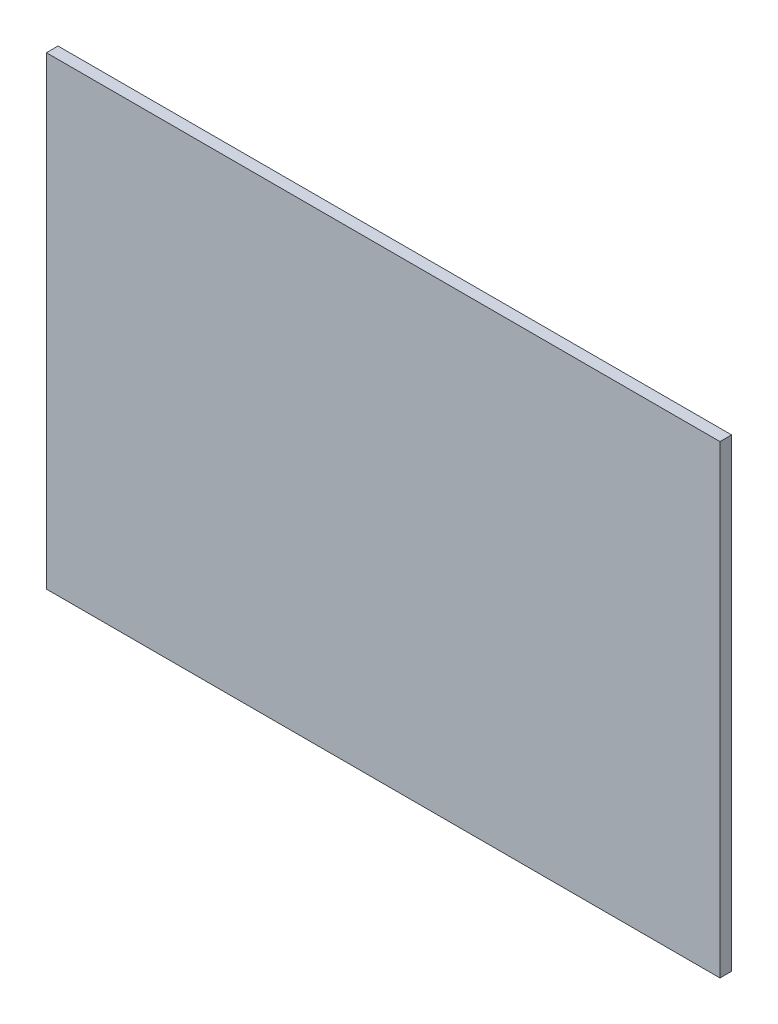
ISO-10303-21;
HEADER;
FILE_DESCRIPTION(('STEP AP214'),'2;1');
FILE_NAME('part.step','',(''),(''),'','','');
FILE_SCHEMA(('AUTOMOTIVE_DESIGN { 1 0 10303 214 1 1 1 1 }'));
ENDSEC;
DATA;
#1=APPLICATION_CONTEXT('core data for automotive mechanical design processes');
#2=APPLICATION_PROTOCOL_DEFINITION('international standard','automotive_design',2000,#1);
#3=PRODUCT_CONTEXT('',#1,'mechanical');
#4=PRODUCT('Part','Part','',(#3));
#5=PRODUCT_RELATED_PRODUCT_CATEGORY('part','',(#4));
#6=PRODUCT_DEFINITION_FORMATION('','',#4);
#7=PRODUCT_DEFINITION_CONTEXT('part definition',#1,'design');
#8=PRODUCT_DEFINITION('design','',#6,#7);
#9=PRODUCT_DEFINITION_SHAPE('','',#8);
#10=(LENGTH_UNIT() NAMED_UNIT(*) SI_UNIT(.MILLI.,.METRE.));
#11=(NAMED_UNIT(*) PLANE_ANGLE_UNIT() SI_UNIT($,.RADIAN.));
#12=(NAMED_UNIT(*) SI_UNIT($,.STERADIAN.) SOLID_ANGLE_UNIT());
#13=UNCERTAINTY_MEASURE_WITH_UNIT(LENGTH_MEASURE(1.E-05),#10,'distance_accuracy_value','');
#14=(GEOMETRIC_REPRESENTATION_CONTEXT(3) GLOBAL_UNCERTAINTY_ASSIGNED_CONTEXT((#13)) GLOBAL_UNIT_ASSIGNED_CONTEXT((#10,
#11,#12)) REPRESENTATION_CONTEXT('',''));
#15=CARTESIAN_POINT('',(0.,0.,0.));
#16=DIRECTION('',(0.,0.,1.));
#17=DIRECTION('',(1.,0.,0.));
#18=AXIS2_PLACEMENT_3D('',#15,#16,#17);
#19=CARTESIAN_POINT('',(-59.8125438596491,34.9027192982456,2.54));
#20=DIRECTION('',(1.,0.,0.));
#21=DIRECTION('',(0.,1.,0.));
#22=AXIS2_PLACEMENT_3D('',#19,#20,#21);
#23=PLANE('',#22);
#24=DIRECTION('',(0.,-1.,0.));
#25=VECTOR('',#24,1.);
#26=CARTESIAN_POINT('',(-59.8125438596491,34.9027192982456,0.));
#27=LINE('',#26,#25);
#28=CARTESIAN_POINT('',(-59.8125438596491,34.9027192982456,0.));
#29=VERTEX_POINT('',#28);
#30=CARTESIAN_POINT('',(-59.8125438596491,-66.6972781617544,0.));
#31=VERTEX_POINT('',#30);
#32=EDGE_CURVE('E109',#29,#31,#27,.T.);
#33=ORIENTED_EDGE('',*,*,#32,.T.);
#34=DIRECTION('',(0.,0.,-1.));
#35=VECTOR('',#34,1.);
#36=CARTESIAN_POINT('',(-59.8125438596491,-66.6972781617544,2.54));
#37=LINE('',#36,#35);
#38=CARTESIAN_POINT('',(-59.8125438596491,-66.6972781617544,2.54));
#39=VERTEX_POINT('',#38);
#40=EDGE_CURVE('E11',#39,#31,#37,.T.);
#41=ORIENTED_EDGE('',*,*,#40,.F.);
#42=DIRECTION('',(0.,-1.,0.));
#43=VECTOR('',#42,1.);
#44=CARTESIAN_POINT('',(-59.8125438596491,34.9027192982456,2.54));
#45=LINE('',#44,#43);
#46=CARTESIAN_POINT('',(-59.8125438596491,34.9027192982456,2.54));
#47=VERTEX_POINT('',#46);
#48=EDGE_CURVE('E93',#47,#39,#45,.T.);
#49=ORIENTED_EDGE('',*,*,#48,.F.);
#50=DIRECTION('',(0.,0.,-1.));
#51=VECTOR('',#50,1.);
#52=CARTESIAN_POINT('',(-59.8125438596491,34.9027192982456,2.54));
#53=LINE('',#52,#51);
#54=EDGE_CURVE('E105',#47,#29,#53,.T.);
#55=ORIENTED_EDGE('',*,*,#54,.T.);
#56=EDGE_LOOP('',(#33,#41,#49,#55));
#57=FACE_BOUND('',#56,.T.);
#58=ADVANCED_FACE('F41',(#57),#23,.F.);
#59=CARTESIAN_POINT('',(-59.8125438596491,-66.6972781617544,2.54));
#60=DIRECTION('',(0.,1.,0.));
#61=DIRECTION('',(0.,0.,1.));
#62=AXIS2_PLACEMENT_3D('',#59,#60,#61);
#63=PLANE('',#62);
#64=DIRECTION('',(1.,0.,0.));
#65=VECTOR('',#64,1.);
#66=CARTESIAN_POINT('',(-59.8125438596491,-66.6972781617544,0.));
#67=LINE('',#66,#65);
#68=CARTESIAN_POINT('',(87.5074561403509,-66.6972781617544,0.));
#69=VERTEX_POINT('',#68);
#70=EDGE_CURVE('E98',#31,#69,#67,.T.);
#71=ORIENTED_EDGE('',*,*,#70,.T.);
#72=DIRECTION('',(0.,0.,-1.));
#73=VECTOR('',#72,1.);
#74=CARTESIAN_POINT('',(87.5074561403509,-66.6972781617544,2.54));
#75=LINE('',#74,#73);
#76=CARTESIAN_POINT('',(87.5074561403509,-66.6972781617544,2.54));
#77=VERTEX_POINT('',#76);
#78=EDGE_CURVE('E50',#77,#69,#75,.T.);
#79=ORIENTED_EDGE('',*,*,#78,.F.);
#80=DIRECTION('',(1.,0.,0.));
#81=VECTOR('',#80,1.);
#82=CARTESIAN_POINT('',(-59.8125438596491,-66.6972781617544,2.54));
#83=LINE('',#82,#81);
#84=EDGE_CURVE('E88',#39,#77,#83,.T.);
#85=ORIENTED_EDGE('',*,*,#84,.F.);
#86=ORIENTED_EDGE('',*,*,#40,.T.);
#87=EDGE_LOOP('',(#71,#79,#85,#86));
#88=FACE_BOUND('',#87,.T.);
#89=ADVANCED_FACE('F97',(#88),#63,.F.);
#90=CARTESIAN_POINT('',(87.5074561403509,34.9027192982456,2.54));
#91=DIRECTION('',(-1.,0.,0.));
#92=DIRECTION('',(0.,0.,1.));
#93=AXIS2_PLACEMENT_3D('',#90,#91,#92);
#94=PLANE('',#93);
#95=DIRECTION('',(0.,1.,0.));
#96=VECTOR('',#95,1.);
#97=CARTESIAN_POINT('',(87.5074561403509,34.9027192982456,0.));
#98=LINE('',#97,#96);
#99=CARTESIAN_POINT('',(87.5074561403509,34.9027192982456,0.));
#100=VERTEX_POINT('',#99);
#101=EDGE_CURVE('E75',#69,#100,#98,.T.);
#102=ORIENTED_EDGE('',*,*,#101,.T.);
#103=DIRECTION('',(0.,0.,-1.));
#104=VECTOR('',#103,1.);
#105=CARTESIAN_POINT('',(87.5074561403509,34.9027192982456,2.54));
#106=LINE('',#105,#104);
#107=CARTESIAN_POINT('',(87.5074561403509,34.9027192982456,2.54));
#108=VERTEX_POINT('',#107);
#109=EDGE_CURVE('E100',#108,#100,#106,.T.);
#110=ORIENTED_EDGE('',*,*,#109,.F.);
#111=DIRECTION('',(0.,1.,0.));
#112=VECTOR('',#111,1.);
#113=CARTESIAN_POINT('',(87.5074561403509,34.9027192982456,2.54));
#114=LINE('',#113,#112);
#115=EDGE_CURVE('E91',#77,#108,#114,.T.);
#116=ORIENTED_EDGE('',*,*,#115,.F.);
#117=ORIENTED_EDGE('',*,*,#78,.T.);
#118=EDGE_LOOP('',(#102,#110,#116,#117));
#119=FACE_BOUND('',#118,.T.);
#120=ADVANCED_FACE('F101',(#119),#94,.F.);
#121=CARTESIAN_POINT('',(-59.8125438596491,34.9027192982456,2.54));
#122=DIRECTION('',(0.,-1.,0.));
#123=DIRECTION('',(0.,0.,-1.));
#124=AXIS2_PLACEMENT_3D('',#121,#122,#123);
#125=PLANE('',#124);
#126=DIRECTION('',(-1.,0.,0.));
#127=VECTOR('',#126,1.);
#128=CARTESIAN_POINT('',(-59.8125438596491,34.9027192982456,0.));
#129=LINE('',#128,#127);
#130=EDGE_CURVE('E81',#100,#29,#129,.T.);
#131=ORIENTED_EDGE('',*,*,#130,.T.);
#132=ORIENTED_EDGE('',*,*,#54,.F.);
#133=DIRECTION('',(-1.,0.,0.));
#134=VECTOR('',#133,1.);
#135=CARTESIAN_POINT('',(-59.8125438596491,34.9027192982456,2.54));
#136=LINE('',#135,#134);
#137=EDGE_CURVE('E58',#108,#47,#136,.T.);
#138=ORIENTED_EDGE('',*,*,#137,.F.);
#139=ORIENTED_EDGE('',*,*,#109,.T.);
#140=EDGE_LOOP('',(#131,#132,#138,#139));
#141=FACE_BOUND('',#140,.T.);
#142=ADVANCED_FACE('F122',(#141),#125,.F.);
#143=CARTESIAN_POINT('',(0.,0.,2.54));
#144=DIRECTION('',(0.,0.,1.));
#145=DIRECTION('',(1.,0.,0.));
#146=AXIS2_PLACEMENT_3D('',#143,#144,#145);
#147=PLANE('',#146);
#148=ORIENTED_EDGE('',*,*,#48,.T.);
#149=ORIENTED_EDGE('',*,*,#84,.T.);
#150=ORIENTED_EDGE('',*,*,#115,.T.);
#151=ORIENTED_EDGE('',*,*,#137,.T.);
#152=EDGE_LOOP('',(#148,#149,#150,#151));
#153=FACE_BOUND('',#152,.T.);
#154=ADVANCED_FACE('F89',(#153),#147,.T.);
#155=CARTESIAN_POINT('',(0.,0.,0.));
#156=DIRECTION('',(0.,0.,1.));
#157=DIRECTION('',(1.,0.,0.));
#158=AXIS2_PLACEMENT_3D('',#155,#156,#157);
#159=PLANE('',#158);
#160=ORIENTED_EDGE('',*,*,#32,.F.);
#161=ORIENTED_EDGE('',*,*,#130,.F.);
#162=ORIENTED_EDGE('',*,*,#101,.F.);
#163=ORIENTED_EDGE('',*,*,#70,.F.);
#164=EDGE_LOOP('',(#160,#161,#162,#163));
#165=FACE_BOUND('',#164,.T.);
#166=ADVANCED_FACE('F125',(#165),#159,.F.);
#167=CLOSED_SHELL('',(#58,#89,#120,#142,#154,#166));
#168=MANIFOLD_SOLID_BREP('B2',#167);
#169=ADVANCED_BREP_SHAPE_REPRESENTATION('',(#18,#168),#14);
#170=SHAPE_DEFINITION_REPRESENTATION(#9,#169);
ENDSEC;
END-ISO-10303-21;
